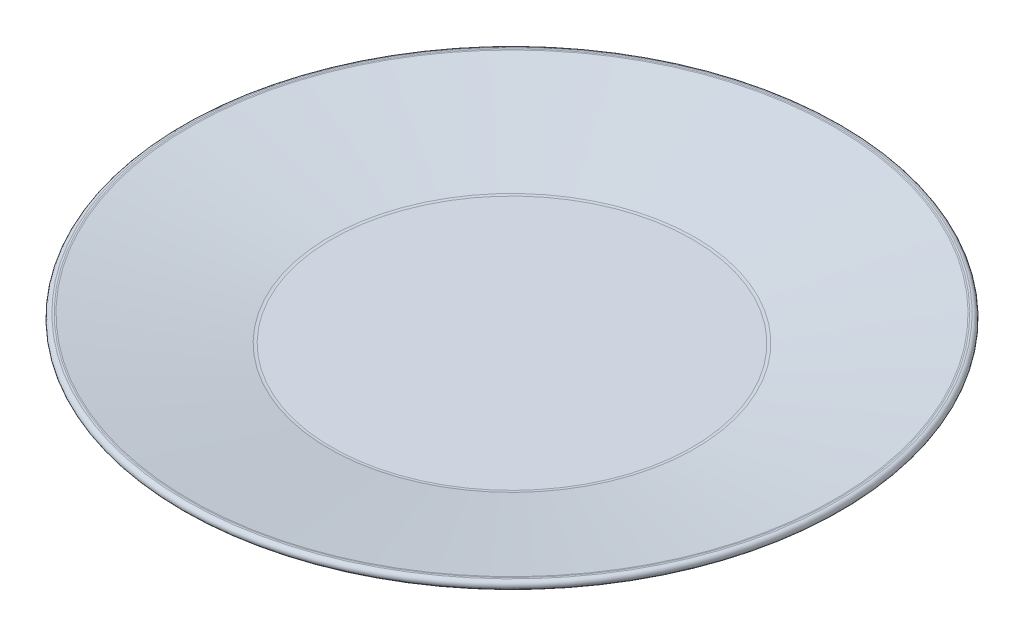
ISO-10303-21;
HEADER;
FILE_DESCRIPTION(('STEP AP214'),'2;1');
FILE_NAME('part.step','',(''),(''),'','','');
FILE_SCHEMA(('AUTOMOTIVE_DESIGN { 1 0 10303 214 1 1 1 1 }'));
ENDSEC;
DATA;
#1=APPLICATION_CONTEXT('core data for automotive mechanical design processes');
#2=APPLICATION_PROTOCOL_DEFINITION('international standard','automotive_design',2000,#1);
#3=PRODUCT_CONTEXT('',#1,'mechanical');
#4=PRODUCT('Part','Part','',(#3));
#5=PRODUCT_RELATED_PRODUCT_CATEGORY('part','',(#4));
#6=PRODUCT_DEFINITION_FORMATION('','',#4);
#7=PRODUCT_DEFINITION_CONTEXT('part definition',#1,'design');
#8=PRODUCT_DEFINITION('design','',#6,#7);
#9=PRODUCT_DEFINITION_SHAPE('','',#8);
#10=(LENGTH_UNIT() NAMED_UNIT(*) SI_UNIT(.MILLI.,.METRE.));
#11=(NAMED_UNIT(*) PLANE_ANGLE_UNIT() SI_UNIT($,.RADIAN.));
#12=(NAMED_UNIT(*) SI_UNIT($,.STERADIAN.) SOLID_ANGLE_UNIT());
#13=UNCERTAINTY_MEASURE_WITH_UNIT(LENGTH_MEASURE(1.E-05),#10,'distance_accuracy_value','');
#14=(GEOMETRIC_REPRESENTATION_CONTEXT(3) GLOBAL_UNCERTAINTY_ASSIGNED_CONTEXT((#13)) GLOBAL_UNIT_ASSIGNED_CONTEXT((#10,
#11,#12)) REPRESENTATION_CONTEXT('',''));
#15=CARTESIAN_POINT('',(0.,0.,0.));
#16=DIRECTION('',(0.,0.,1.));
#17=DIRECTION('',(1.,0.,0.));
#18=AXIS2_PLACEMENT_3D('',#15,#16,#17);
#19=CARTESIAN_POINT('',(0.,2.5,0.));
#20=DIRECTION('',(0.,1.,0.));
#21=DIRECTION('',(0.,0.,1.));
#22=AXIS2_PLACEMENT_3D('',#19,#20,#21);
#23=PLANE('',#22);
#24=CARTESIAN_POINT('',(0.,2.5,0.));
#25=DIRECTION('',(0.,-1.,0.));
#26=DIRECTION('',(0.,0.,-1.));
#27=AXIS2_PLACEMENT_3D('',#24,#25,#26);
#28=CIRCLE('',#27,51.9562184222309);
#29=CARTESIAN_POINT('',(0.,2.5,-51.9562184222309));
#30=VERTEX_POINT('',#29);
#31=EDGE_CURVE('E10',#30,#30,#28,.T.);
#32=ORIENTED_EDGE('',*,*,#31,.F.);
#33=EDGE_LOOP('',(#32));
#34=FACE_BOUND('',#33,.T.);
#35=ADVANCED_FACE('F33',(#34),#23,.T.);
#36=CARTESIAN_POINT('',(0.,7.,0.));
#37=DIRECTION('',(0.,-1.,0.));
#38=DIRECTION('',(0.,0.,-1.));
#39=AXIS2_PLACEMENT_3D('',#36,#37,#38);
#40=TOROIDAL_SURFACE('',#39,51.9562184222309,4.5);
#41=ORIENTED_EDGE('',*,*,#31,.T.);
#42=EDGE_LOOP('',(#41));
#43=FACE_BOUND('',#42,.T.);
#44=CARTESIAN_POINT('',(0.,2.57425824131468,0.));
#45=DIRECTION('',(0.,-1.,0.));
#46=DIRECTION('',(0.,0.,-1.));
#47=AXIS2_PLACEMENT_3D('',#44,#45,#46);
#48=CIRCLE('',#47,52.7703497908865);
#49=CARTESIAN_POINT('',(0.,2.57425824131468,-52.7703497908865));
#50=VERTEX_POINT('',#49);
#51=EDGE_CURVE('E39',#50,#50,#48,.T.);
#52=ORIENTED_EDGE('',*,*,#51,.F.);
#53=EDGE_LOOP('',(#52));
#54=FACE_BOUND('',#53,.T.);
#55=ADVANCED_FACE('F81',(#43,#54),#40,.F.);
#56=CARTESIAN_POINT('',(0.,9.96699633719347,0.));
#57=DIRECTION('',(0.,1.,0.));
#58=DIRECTION('',(0.,0.,1.));
#59=AXIS2_PLACEMENT_3D('',#56,#57,#58);
#60=CONICAL_SURFACE('',#59,92.9583967838243,1.38887646939275);
#61=ORIENTED_EDGE('',*,*,#51,.T.);
#62=EDGE_LOOP('',(#61));
#63=FACE_BOUND('',#62,.T.);
#64=CARTESIAN_POINT('',(0.,9.96699633719347,0.));
#65=DIRECTION('',(0.,-1.,0.));
#66=DIRECTION('',(0.,0.,-1.));
#67=AXIS2_PLACEMENT_3D('',#64,#65,#66);
#68=CIRCLE('',#67,92.9583967838243);
#69=CARTESIAN_POINT('',(0.,9.96699633719347,-92.9583967838243));
#70=VERTEX_POINT('',#69);
#71=EDGE_CURVE('E43',#70,#70,#68,.T.);
#72=ORIENTED_EDGE('',*,*,#71,.F.);
#73=EDGE_LOOP('',(#72));
#74=FACE_BOUND('',#73,.T.);
#75=ADVANCED_FACE('F86',(#63,#74),#60,.F.);
#76=CARTESIAN_POINT('',(0.,8.,0.));
#77=DIRECTION('',(0.,-1.,0.));
#78=DIRECTION('',(0.,0.,-1.));
#79=AXIS2_PLACEMENT_3D('',#76,#77,#78);
#80=TOROIDAL_SURFACE('',#79,93.3202329476712,2.);
#81=ORIENTED_EDGE('',*,*,#71,.T.);
#82=EDGE_LOOP('',(#81));
#83=FACE_BOUND('',#82,.T.);
#84=CARTESIAN_POINT('',(0.,10.,0.));
#85=DIRECTION('',(0.,-1.,0.));
#86=DIRECTION('',(0.,0.,-1.));
#87=AXIS2_PLACEMENT_3D('',#84,#85,#86);
#88=CIRCLE('',#87,93.3202329476712);
#89=CARTESIAN_POINT('',(0.,10.,-93.3202329476712));
#90=VERTEX_POINT('',#89);
#91=EDGE_CURVE('E47',#90,#90,#88,.T.);
#92=ORIENTED_EDGE('',*,*,#91,.F.);
#93=EDGE_LOOP('',(#92));
#94=FACE_BOUND('',#93,.T.);
#95=ADVANCED_FACE('F90',(#83,#94),#80,.T.);
#96=CARTESIAN_POINT('',(93.8,10.,0.));
#97=DIRECTION('',(0.,1.,0.));
#98=DIRECTION('',(0.,0.,1.));
#99=AXIS2_PLACEMENT_3D('',#96,#97,#98);
#100=PLANE('',#99);
#101=ORIENTED_EDGE('',*,*,#91,.T.);
#102=EDGE_LOOP('',(#101));
#103=FACE_BOUND('',#102,.T.);
#104=CARTESIAN_POINT('',(0.,10.,0.));
#105=DIRECTION('',(0.,-1.,0.));
#106=DIRECTION('',(0.,0.,-1.));
#107=AXIS2_PLACEMENT_3D('',#104,#105,#106);
#108=CIRCLE('',#107,93.8);
#109=CARTESIAN_POINT('',(0.,10.,-93.8));
#110=VERTEX_POINT('',#109);
#111=EDGE_CURVE('E52',#110,#110,#108,.T.);
#112=ORIENTED_EDGE('',*,*,#111,.F.);
#113=EDGE_LOOP('',(#112));
#114=FACE_BOUND('',#113,.T.);
#115=ADVANCED_FACE('F96',(#103,#114),#100,.T.);
#116=CARTESIAN_POINT('',(0.,8.8,0.));
#117=DIRECTION('',(0.,-1.,0.));
#118=DIRECTION('',(0.,0.,-1.));
#119=AXIS2_PLACEMENT_3D('',#116,#117,#118);
#120=TOROIDAL_SURFACE('',#119,93.8,1.2);
#121=ORIENTED_EDGE('',*,*,#111,.T.);
#122=EDGE_LOOP('',(#121));
#123=FACE_BOUND('',#122,.T.);
#124=CARTESIAN_POINT('',(0.,7.61980219768391,0.));
#125=DIRECTION('',(0.,-1.,0.));
#126=DIRECTION('',(0.,0.,-1.));
#127=AXIS2_PLACEMENT_3D('',#124,#125,#126);
#128=CIRCLE('',#127,94.0171016983081);
#129=CARTESIAN_POINT('',(0.,7.61980219768391,-94.0171016983081));
#130=VERTEX_POINT('',#129);
#131=EDGE_CURVE('E55',#130,#130,#128,.T.);
#132=ORIENTED_EDGE('',*,*,#131,.F.);
#133=EDGE_LOOP('',(#132));
#134=FACE_BOUND('',#133,.T.);
#135=ADVANCED_FACE('F77',(#123,#134),#120,.T.);
#136=CARTESIAN_POINT('',(0.,0.115512819822838,0.));
#137=DIRECTION('',(0.,1.,0.));
#138=DIRECTION('',(0.,0.,1.));
#139=AXIS2_PLACEMENT_3D('',#136,#137,#138);
#140=CONICAL_SURFACE('',#139,53.2226449956951,1.38887646939275);
#141=ORIENTED_EDGE('',*,*,#131,.T.);
#142=EDGE_LOOP('',(#141));
#143=FACE_BOUND('',#142,.T.);
#144=CARTESIAN_POINT('',(0.,0.115512819822838,0.));
#145=DIRECTION('',(0.,-1.,0.));
#146=DIRECTION('',(0.,0.,-1.));
#147=AXIS2_PLACEMENT_3D('',#144,#145,#146);
#148=CIRCLE('',#147,53.2226449956951);
#149=CARTESIAN_POINT('',(0.,0.115512819822838,-53.2226449956951));
#150=VERTEX_POINT('',#149);
#151=EDGE_CURVE('E58',#150,#150,#148,.T.);
#152=ORIENTED_EDGE('',*,*,#151,.F.);
#153=EDGE_LOOP('',(#152));
#154=FACE_BOUND('',#153,.T.);
#155=ADVANCED_FACE('F69',(#143,#154),#140,.T.);
#156=CARTESIAN_POINT('',(0.,7.,0.));
#157=DIRECTION('',(0.,-1.,0.));
#158=DIRECTION('',(0.,0.,-1.));
#159=AXIS2_PLACEMENT_3D('',#156,#157,#158);
#160=TOROIDAL_SURFACE('',#159,51.9562184222309,7.);
#161=ORIENTED_EDGE('',*,*,#151,.T.);
#162=EDGE_LOOP('',(#161));
#163=FACE_BOUND('',#162,.T.);
#164=CARTESIAN_POINT('',(0.,0.,0.));
#165=DIRECTION('',(0.,-1.,0.));
#166=DIRECTION('',(0.,0.,-1.));
#167=AXIS2_PLACEMENT_3D('',#164,#165,#166);
#168=CIRCLE('',#167,51.9562184222309);
#169=CARTESIAN_POINT('',(0.,0.,-51.9562184222309));
#170=VERTEX_POINT('',#169);
#171=EDGE_CURVE('E61',#170,#170,#168,.T.);
#172=ORIENTED_EDGE('',*,*,#171,.F.);
#173=EDGE_LOOP('',(#172));
#174=FACE_BOUND('',#173,.T.);
#175=ADVANCED_FACE('F67',(#163,#174),#160,.T.);
#176=CARTESIAN_POINT('',(0.,0.,0.));
#177=DIRECTION('',(0.,-1.,0.));
#178=DIRECTION('',(0.,0.,-1.));
#179=AXIS2_PLACEMENT_3D('',#176,#177,#178);
#180=PLANE('',#179);
#181=ORIENTED_EDGE('',*,*,#171,.T.);
#182=EDGE_LOOP('',(#181));
#183=FACE_BOUND('',#182,.T.);
#184=ADVANCED_FACE('F65',(#183),#180,.T.);
#185=CLOSED_SHELL('',(#35,#55,#75,#95,#115,#135,#155,#175,#184));
#186=MANIFOLD_SOLID_BREP('B2',#185);
#187=ADVANCED_BREP_SHAPE_REPRESENTATION('',(#18,#186),#14);
#188=SHAPE_DEFINITION_REPRESENTATION(#9,#187);
ENDSEC;
END-ISO-10303-21;
